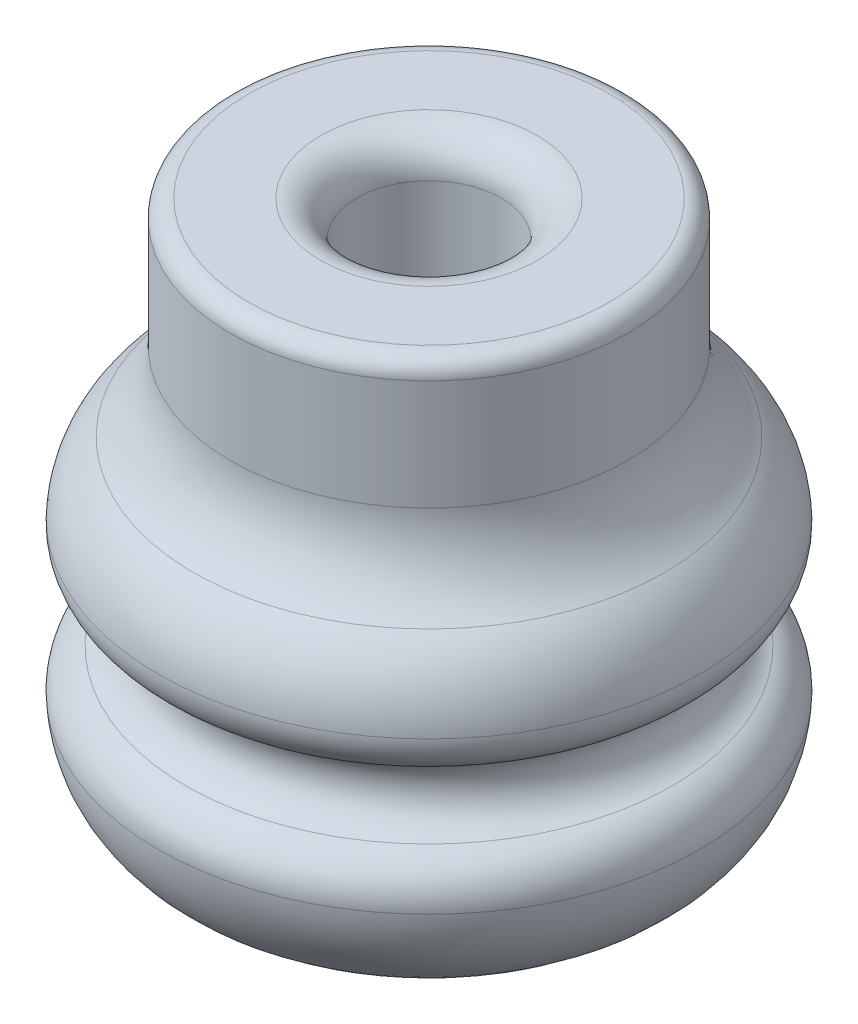
ISO-10303-21;
HEADER;
FILE_DESCRIPTION(('STEP AP214'),'2;1');
FILE_NAME('part.step','',(''),(''),'','','');
FILE_SCHEMA(('AUTOMOTIVE_DESIGN { 1 0 10303 214 1 1 1 1 }'));
ENDSEC;
DATA;
#1=APPLICATION_CONTEXT('core data for automotive mechanical design processes');
#2=APPLICATION_PROTOCOL_DEFINITION('international standard','automotive_design',2000,#1);
#3=PRODUCT_CONTEXT('',#1,'mechanical');
#4=PRODUCT('Part','Part','',(#3));
#5=PRODUCT_RELATED_PRODUCT_CATEGORY('part','',(#4));
#6=PRODUCT_DEFINITION_FORMATION('','',#4);
#7=PRODUCT_DEFINITION_CONTEXT('part definition',#1,'design');
#8=PRODUCT_DEFINITION('design','',#6,#7);
#9=PRODUCT_DEFINITION_SHAPE('','',#8);
#10=(LENGTH_UNIT() NAMED_UNIT(*) SI_UNIT(.MILLI.,.METRE.));
#11=(NAMED_UNIT(*) PLANE_ANGLE_UNIT() SI_UNIT($,.RADIAN.));
#12=(NAMED_UNIT(*) SI_UNIT($,.STERADIAN.) SOLID_ANGLE_UNIT());
#13=UNCERTAINTY_MEASURE_WITH_UNIT(LENGTH_MEASURE(1.E-05),#10,'distance_accuracy_value','');
#14=(GEOMETRIC_REPRESENTATION_CONTEXT(3) GLOBAL_UNCERTAINTY_ASSIGNED_CONTEXT((#13)) GLOBAL_UNIT_ASSIGNED_CONTEXT((#10,
#11,#12)) REPRESENTATION_CONTEXT('',''));
#15=CARTESIAN_POINT('',(0.,0.,0.));
#16=DIRECTION('',(0.,0.,1.));
#17=DIRECTION('',(1.,0.,0.));
#18=AXIS2_PLACEMENT_3D('',#15,#16,#17);
#19=CARTESIAN_POINT('',(-10.,30.,0.));
#20=DIRECTION('',(0.,1.,0.));
#21=DIRECTION('',(-1.,0.,0.));
#22=AXIS2_PLACEMENT_3D('',#19,#20,#21);
#23=PLANE('',#22);
#24=CARTESIAN_POINT('',(0.,30.,0.));
#25=DIRECTION('',(0.,1.,0.));
#26=DIRECTION('',(-1.,0.,0.));
#27=AXIS2_PLACEMENT_3D('',#24,#25,#26);
#28=CIRCLE('',#27,6.);
#29=CARTESIAN_POINT('',(-6.,30.,0.));
#30=VERTEX_POINT('',#29);
#31=EDGE_CURVE('E11',#30,#30,#28,.F.);
#32=ORIENTED_EDGE('',*,*,#31,.T.);
#33=EDGE_LOOP('',(#32));
#34=FACE_BOUND('',#33,.T.);
#35=CARTESIAN_POINT('',(0.,30.,0.));
#36=DIRECTION('',(0.,1.,0.));
#37=DIRECTION('',(-1.,0.,0.));
#38=AXIS2_PLACEMENT_3D('',#35,#36,#37);
#39=CIRCLE('',#38,10.);
#40=CARTESIAN_POINT('',(-10.,30.,0.));
#41=VERTEX_POINT('',#40);
#42=EDGE_CURVE('E87',#41,#41,#39,.T.);
#43=ORIENTED_EDGE('',*,*,#42,.T.);
#44=EDGE_LOOP('',(#43));
#45=FACE_BOUND('',#44,.T.);
#46=ADVANCED_FACE('F39',(#34,#45),#23,.T.);
#47=CARTESIAN_POINT('',(0.,0.,0.));
#48=DIRECTION('',(0.,-1.,0.));
#49=DIRECTION('',(1.,0.,0.));
#50=AXIS2_PLACEMENT_3D('',#47,#48,#49);
#51=PLANE('',#50);
#52=CARTESIAN_POINT('',(0.,0.,0.));
#53=DIRECTION('',(0.,1.,0.));
#54=DIRECTION('',(-1.,0.,0.));
#55=AXIS2_PLACEMENT_3D('',#52,#53,#54);
#56=CIRCLE('',#55,8.40545953794972);
#57=CARTESIAN_POINT('',(-8.40545953794972,0.,0.));
#58=VERTEX_POINT('',#57);
#59=EDGE_CURVE('E52',#58,#58,#56,.T.);
#60=ORIENTED_EDGE('',*,*,#59,.F.);
#61=EDGE_LOOP('',(#60));
#62=FACE_BOUND('',#61,.T.);
#63=ADVANCED_FACE('F109',(#62),#51,.T.);
#64=CARTESIAN_POINT('',(0.,6.60487688593732,0.));
#65=DIRECTION('',(0.,1.,0.));
#66=DIRECTION('',(-1.,0.,0.));
#67=AXIS2_PLACEMENT_3D('',#64,#65,#66);
#68=TOROIDAL_SURFACE('',#67,8.40545953794972,6.60487688593732);
#69=ORIENTED_EDGE('',*,*,#59,.T.);
#70=EDGE_LOOP('',(#69));
#71=FACE_BOUND('',#70,.T.);
#72=CARTESIAN_POINT('',(0.,6.23550610640715,0.));
#73=DIRECTION('',(0.,1.,0.));
#74=DIRECTION('',(-1.,0.,0.));
#75=AXIS2_PLACEMENT_3D('',#72,#73,#74);
#76=CIRCLE('',#75,15.);
#77=CARTESIAN_POINT('',(-15.,6.23550610640715,0.));
#78=VERTEX_POINT('',#77);
#79=EDGE_CURVE('E57',#78,#78,#76,.T.);
#80=ORIENTED_EDGE('',*,*,#79,.F.);
#81=EDGE_LOOP('',(#80));
#82=FACE_BOUND('',#81,.T.);
#83=ADVANCED_FACE('F113',(#71,#82),#68,.T.);
#84=CARTESIAN_POINT('',(0.,6.36414330158011,0.));
#85=DIRECTION('',(0.,1.,0.));
#86=DIRECTION('',(-1.,0.,0.));
#87=AXIS2_PLACEMENT_3D('',#84,#85,#86);
#88=TOROIDAL_SURFACE('',#87,12.7033830624833,2.3002167040674);
#89=ORIENTED_EDGE('',*,*,#79,.T.);
#90=EDGE_LOOP('',(#89));
#91=FACE_BOUND('',#90,.T.);
#92=CARTESIAN_POINT('',(0.,8.52990879311456,0.));
#93=DIRECTION('',(0.,1.,0.));
#94=DIRECTION('',(-1.,0.,0.));
#95=AXIS2_PLACEMENT_3D('',#92,#93,#94);
#96=CIRCLE('',#95,13.4782744880064);
#97=CARTESIAN_POINT('',(-13.4782744880064,8.52990879311456,0.));
#98=VERTEX_POINT('',#97);
#99=EDGE_CURVE('E63',#98,#98,#96,.T.);
#100=ORIENTED_EDGE('',*,*,#99,.F.);
#101=EDGE_LOOP('',(#100));
#102=FACE_BOUND('',#101,.T.);
#103=ADVANCED_FACE('F120',(#91,#102),#88,.T.);
#104=CARTESIAN_POINT('',(0.,10.441611914672,0.));
#105=DIRECTION('',(0.,1.,0.));
#106=DIRECTION('',(-1.,0.,0.));
#107=AXIS2_PLACEMENT_3D('',#104,#105,#106);
#108=TOROIDAL_SURFACE('',#107,14.1622646812341,2.03038208458515);
#109=ORIENTED_EDGE('',*,*,#99,.T.);
#110=EDGE_LOOP('',(#109));
#111=FACE_BOUND('',#110,.T.);
#112=CARTESIAN_POINT('',(0.,12.3533150362295,0.));
#113=DIRECTION('',(0.,1.,0.));
#114=DIRECTION('',(-1.,0.,0.));
#115=AXIS2_PLACEMENT_3D('',#112,#113,#114);
#116=CIRCLE('',#115,13.4782744880064);
#117=CARTESIAN_POINT('',(-13.4782744880064,12.3533150362295,0.));
#118=VERTEX_POINT('',#117);
#119=EDGE_CURVE('E67',#118,#118,#116,.T.);
#120=ORIENTED_EDGE('',*,*,#119,.F.);
#121=EDGE_LOOP('',(#120));
#122=FACE_BOUND('',#121,.T.);
#123=ADVANCED_FACE('F124',(#111,#122),#108,.F.);
#124=CARTESIAN_POINT('',(0.,14.5190805277639,0.));
#125=DIRECTION('',(0.,1.,0.));
#126=DIRECTION('',(-1.,0.,0.));
#127=AXIS2_PLACEMENT_3D('',#124,#125,#126);
#128=TOROIDAL_SURFACE('',#127,12.7033830624833,2.3002167040674);
#129=ORIENTED_EDGE('',*,*,#119,.T.);
#130=EDGE_LOOP('',(#129));
#131=FACE_BOUND('',#130,.T.);
#132=CARTESIAN_POINT('',(0.,14.6477177229369,0.));
#133=DIRECTION('',(0.,1.,0.));
#134=DIRECTION('',(-1.,0.,0.));
#135=AXIS2_PLACEMENT_3D('',#132,#133,#134);
#136=CIRCLE('',#135,15.);
#137=CARTESIAN_POINT('',(-15.,14.6477177229369,0.));
#138=VERTEX_POINT('',#137);
#139=EDGE_CURVE('E71',#138,#138,#136,.T.);
#140=ORIENTED_EDGE('',*,*,#139,.F.);
#141=EDGE_LOOP('',(#140));
#142=FACE_BOUND('',#141,.T.);
#143=ADVANCED_FACE('F128',(#131,#142),#128,.T.);
#144=CARTESIAN_POINT('',(0.,14.3421514244053,0.));
#145=DIRECTION('',(0.,1.,0.));
#146=DIRECTION('',(-1.,0.,0.));
#147=AXIS2_PLACEMENT_3D('',#144,#145,#146);
#148=TOROIDAL_SURFACE('',#147,9.54458925508686,5.46396167249662);
#149=ORIENTED_EDGE('',*,*,#139,.T.);
#150=EDGE_LOOP('',(#149));
#151=FACE_BOUND('',#150,.T.);
#152=CARTESIAN_POINT('',(0.,18.5406729518909,0.));
#153=DIRECTION('',(0.,1.,0.));
#154=DIRECTION('',(-1.,0.,0.));
#155=AXIS2_PLACEMENT_3D('',#152,#153,#154);
#156=CIRCLE('',#155,13.0413440565781);
#157=CARTESIAN_POINT('',(-13.0413440565781,18.5406729518909,0.));
#158=VERTEX_POINT('',#157);
#159=EDGE_CURVE('E75',#158,#158,#156,.T.);
#160=ORIENTED_EDGE('',*,*,#159,.F.);
#161=EDGE_LOOP('',(#160));
#162=FACE_BOUND('',#161,.T.);
#163=ADVANCED_FACE('F132',(#151,#162),#148,.T.);
#164=CARTESIAN_POINT('',(0.,22.8974221544634,0.));
#165=DIRECTION('',(0.,1.,0.));
#166=DIRECTION('',(-1.,0.,0.));
#167=AXIS2_PLACEMENT_3D('',#164,#165,#166);
#168=TOROIDAL_SURFACE('',#167,16.669879385802,5.66987938580198);
#169=ORIENTED_EDGE('',*,*,#159,.T.);
#170=EDGE_LOOP('',(#169));
#171=FACE_BOUND('',#170,.T.);
#172=CARTESIAN_POINT('',(0.,22.8974221544634,0.));
#173=DIRECTION('',(0.,1.,0.));
#174=DIRECTION('',(-1.,0.,0.));
#175=AXIS2_PLACEMENT_3D('',#172,#173,#174);
#176=CIRCLE('',#175,11.);
#177=CARTESIAN_POINT('',(-11.,22.8974221544634,0.));
#178=VERTEX_POINT('',#177);
#179=EDGE_CURVE('E79',#178,#178,#176,.T.);
#180=ORIENTED_EDGE('',*,*,#179,.F.);
#181=EDGE_LOOP('',(#180));
#182=FACE_BOUND('',#181,.T.);
#183=ADVANCED_FACE('F136',(#171,#182),#168,.F.);
#184=CARTESIAN_POINT('',(0.,30.,0.));
#185=DIRECTION('',(0.,1.,0.));
#186=DIRECTION('',(-1.,0.,0.));
#187=AXIS2_PLACEMENT_3D('',#184,#185,#186);
#188=CYLINDRICAL_SURFACE('',#187,11.);
#189=ORIENTED_EDGE('',*,*,#179,.T.);
#190=EDGE_LOOP('',(#189));
#191=FACE_BOUND('',#190,.T.);
#192=CARTESIAN_POINT('',(0.,29.,0.));
#193=DIRECTION('',(0.,1.,0.));
#194=DIRECTION('',(-1.,0.,0.));
#195=AXIS2_PLACEMENT_3D('',#192,#193,#194);
#196=CIRCLE('',#195,11.);
#197=CARTESIAN_POINT('',(-11.,29.,0.));
#198=VERTEX_POINT('',#197);
#199=EDGE_CURVE('E83',#198,#198,#196,.T.);
#200=ORIENTED_EDGE('',*,*,#199,.F.);
#201=EDGE_LOOP('',(#200));
#202=FACE_BOUND('',#201,.T.);
#203=ADVANCED_FACE('F140',(#191,#202),#188,.T.);
#204=CARTESIAN_POINT('',(0.,29.,0.));
#205=DIRECTION('',(0.,1.,0.));
#206=DIRECTION('',(-1.,0.,0.));
#207=AXIS2_PLACEMENT_3D('',#204,#205,#206);
#208=TOROIDAL_SURFACE('',#207,10.,1.);
#209=ORIENTED_EDGE('',*,*,#199,.T.);
#210=EDGE_LOOP('',(#209));
#211=FACE_BOUND('',#210,.T.);
#212=ORIENTED_EDGE('',*,*,#42,.F.);
#213=EDGE_LOOP('',(#212));
#214=FACE_BOUND('',#213,.T.);
#215=ADVANCED_FACE('F106',(#211,#214),#208,.T.);
#216=CARTESIAN_POINT('',(0.,1.,0.));
#217=DIRECTION('',(0.,-1.,0.));
#218=DIRECTION('',(1.,0.,0.));
#219=AXIS2_PLACEMENT_3D('',#216,#217,#218);
#220=PLANE('',#219);
#221=CARTESIAN_POINT('',(0.,0.999999999999999,0.));
#222=DIRECTION('',(0.,-1.,0.));
#223=DIRECTION('',(1.,0.,0.));
#224=AXIS2_PLACEMENT_3D('',#221,#222,#223);
#225=CIRCLE('',#224,4.);
#226=CARTESIAN_POINT('',(4.,0.999999999999999,0.));
#227=VERTEX_POINT('',#226);
#228=EDGE_CURVE('E91',#227,#227,#225,.F.);
#229=ORIENTED_EDGE('',*,*,#228,.T.);
#230=EDGE_LOOP('',(#229));
#231=FACE_BOUND('',#230,.T.);
#232=ADVANCED_FACE('F96',(#231),#220,.F.);
#233=CARTESIAN_POINT('',(0.,-11.3137084989848,0.));
#234=DIRECTION('',(0.,1.,0.));
#235=DIRECTION('',(-1.,0.,0.));
#236=AXIS2_PLACEMENT_3D('',#233,#234,#235);
#237=CYLINDRICAL_SURFACE('',#236,4.);
#238=CARTESIAN_POINT('',(0.,28.,0.));
#239=DIRECTION('',(0.,1.,0.));
#240=DIRECTION('',(-1.,0.,0.));
#241=AXIS2_PLACEMENT_3D('',#238,#239,#240);
#242=CIRCLE('',#241,4.);
#243=CARTESIAN_POINT('',(-4.,28.,0.));
#244=VERTEX_POINT('',#243);
#245=EDGE_CURVE('E47',#244,#244,#242,.T.);
#246=ORIENTED_EDGE('',*,*,#245,.T.);
#247=EDGE_LOOP('',(#246));
#248=FACE_BOUND('',#247,.T.);
#249=ORIENTED_EDGE('',*,*,#228,.F.);
#250=EDGE_LOOP('',(#249));
#251=FACE_BOUND('',#250,.T.);
#252=ADVANCED_FACE('F98',(#248,#251),#237,.F.);
#253=CARTESIAN_POINT('',(0.,28.,0.));
#254=DIRECTION('',(0.,1.,0.));
#255=DIRECTION('',(-1.,0.,0.));
#256=AXIS2_PLACEMENT_3D('',#253,#254,#255);
#257=TOROIDAL_SURFACE('',#256,6.,2.);
#258=ORIENTED_EDGE('',*,*,#31,.F.);
#259=EDGE_LOOP('',(#258));
#260=FACE_BOUND('',#259,.T.);
#261=ORIENTED_EDGE('',*,*,#245,.F.);
#262=EDGE_LOOP('',(#261));
#263=FACE_BOUND('',#262,.T.);
#264=ADVANCED_FACE('F41',(#260,#263),#257,.T.);
#265=CLOSED_SHELL('',(#46,#63,#83,#103,#123,#143,#163,#183,#203,#215,#232,#252,#264));
#266=MANIFOLD_SOLID_BREP('B2',#265);
#267=ADVANCED_BREP_SHAPE_REPRESENTATION('',(#18,#266),#14);
#268=SHAPE_DEFINITION_REPRESENTATION(#9,#267);
ENDSEC;
END-ISO-10303-21;
